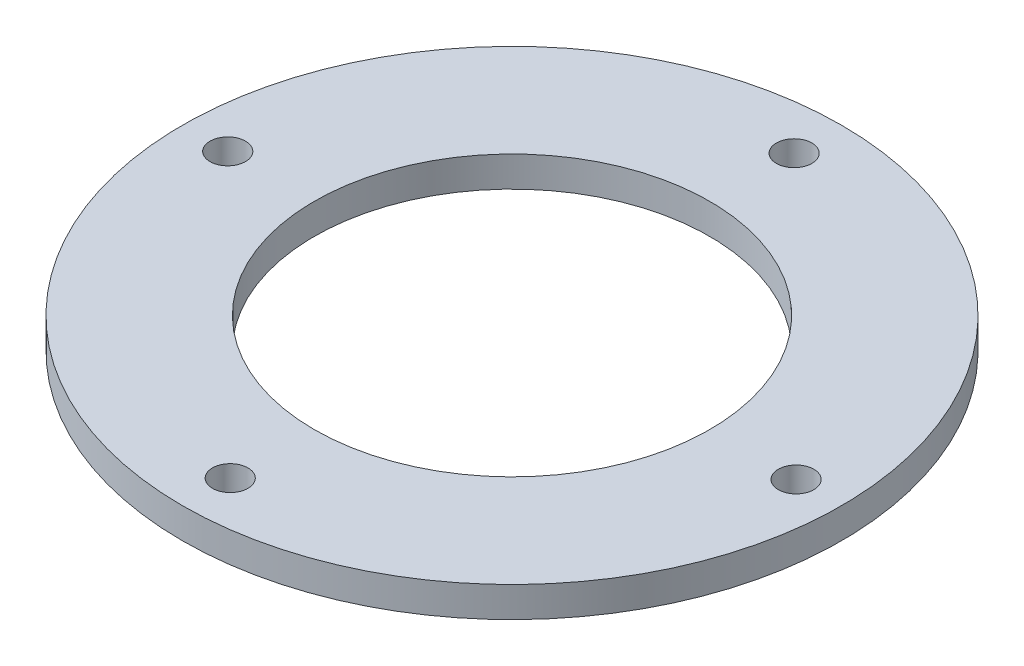
ISO-10303-21;
HEADER;
FILE_DESCRIPTION(('STEP AP214'),'2;1');
FILE_NAME('part.step','',(''),(''),'','','');
FILE_SCHEMA(('AUTOMOTIVE_DESIGN { 1 0 10303 214 1 1 1 1 }'));
ENDSEC;
DATA;
#1=APPLICATION_CONTEXT('core data for automotive mechanical design processes');
#2=APPLICATION_PROTOCOL_DEFINITION('international standard','automotive_design',2000,#1);
#3=PRODUCT_CONTEXT('',#1,'mechanical');
#4=PRODUCT('Part','Part','',(#3));
#5=PRODUCT_RELATED_PRODUCT_CATEGORY('part','',(#4));
#6=PRODUCT_DEFINITION_FORMATION('','',#4);
#7=PRODUCT_DEFINITION_CONTEXT('part definition',#1,'design');
#8=PRODUCT_DEFINITION('design','',#6,#7);
#9=PRODUCT_DEFINITION_SHAPE('','',#8);
#10=(LENGTH_UNIT() NAMED_UNIT(*) SI_UNIT(.MILLI.,.METRE.));
#11=(NAMED_UNIT(*) PLANE_ANGLE_UNIT() SI_UNIT($,.RADIAN.));
#12=(NAMED_UNIT(*) SI_UNIT($,.STERADIAN.) SOLID_ANGLE_UNIT());
#13=UNCERTAINTY_MEASURE_WITH_UNIT(LENGTH_MEASURE(1.E-05),#10,'distance_accuracy_value','');
#14=(GEOMETRIC_REPRESENTATION_CONTEXT(3) GLOBAL_UNCERTAINTY_ASSIGNED_CONTEXT((#13)) GLOBAL_UNIT_ASSIGNED_CONTEXT((#10,
#11,#12)) REPRESENTATION_CONTEXT('',''));
#15=CARTESIAN_POINT('',(0.,0.,0.));
#16=DIRECTION('',(0.,0.,1.));
#17=DIRECTION('',(1.,0.,0.));
#18=AXIS2_PLACEMENT_3D('',#15,#16,#17);
#19=CARTESIAN_POINT('',(0.,3.,0.));
#20=DIRECTION('',(0.,1.,0.));
#21=DIRECTION('',(0.,0.,1.));
#22=AXIS2_PLACEMENT_3D('',#19,#20,#21);
#23=PLANE('',#22);
#24=CARTESIAN_POINT('',(-28.0273872515695,3.,0.00397910375983372));
#25=DIRECTION('',(0.,1.,0.));
#26=DIRECTION('',(0.,0.,1.));
#27=AXIS2_PLACEMENT_3D('',#24,#25,#26);
#28=CIRCLE('',#27,1.75);
#29=CARTESIAN_POINT('',(-28.0273872515695,3.,1.75397910375983));
#30=VERTEX_POINT('',#29);
#31=EDGE_CURVE('E65',#30,#30,#28,.T.);
#32=ORIENTED_EDGE('',*,*,#31,.F.);
#33=EDGE_LOOP('',(#32));
#34=FACE_BOUND('',#33,.T.);
#35=CARTESIAN_POINT('',(28.0161930899202,3.,0.));
#36=DIRECTION('',(0.,1.,0.));
#37=DIRECTION('',(0.,0.,1.));
#38=AXIS2_PLACEMENT_3D('',#35,#36,#37);
#39=CIRCLE('',#38,1.75);
#40=CARTESIAN_POINT('',(28.0161930899202,3.,1.75));
#41=VERTEX_POINT('',#40);
#42=EDGE_CURVE('E68',#41,#41,#39,.T.);
#43=ORIENTED_EDGE('',*,*,#42,.F.);
#44=EDGE_LOOP('',(#43));
#45=FACE_BOUND('',#44,.T.);
#46=CARTESIAN_POINT('',(0.057759674881197,3.,-27.7662693975544));
#47=DIRECTION('',(0.,1.,0.));
#48=DIRECTION('',(0.,0.,1.));
#49=AXIS2_PLACEMENT_3D('',#46,#47,#48);
#50=CIRCLE('',#49,1.75);
#51=CARTESIAN_POINT('',(0.057759674881197,3.,-26.0162693975544));
#52=VERTEX_POINT('',#51);
#53=EDGE_CURVE('E59',#52,#52,#50,.T.);
#54=ORIENTED_EDGE('',*,*,#53,.F.);
#55=EDGE_LOOP('',(#54));
#56=FACE_BOUND('',#55,.T.);
#57=CARTESIAN_POINT('',(0.,3.,27.7888845354006));
#58=DIRECTION('',(0.,1.,0.));
#59=DIRECTION('',(0.,0.,1.));
#60=AXIS2_PLACEMENT_3D('',#57,#58,#59);
#61=CIRCLE('',#60,1.75);
#62=CARTESIAN_POINT('',(0.,3.,29.5388845354006));
#63=VERTEX_POINT('',#62);
#64=EDGE_CURVE('E51',#63,#63,#61,.T.);
#65=ORIENTED_EDGE('',*,*,#64,.F.);
#66=EDGE_LOOP('',(#65));
#67=FACE_BOUND('',#66,.T.);
#68=CARTESIAN_POINT('',(0.,3.,0.));
#69=DIRECTION('',(0.,1.,0.));
#70=DIRECTION('',(0.,0.,1.));
#71=AXIS2_PLACEMENT_3D('',#68,#69,#70);
#72=CIRCLE('',#71,32.5);
#73=CARTESIAN_POINT('',(0.,3.,32.5));
#74=VERTEX_POINT('',#73);
#75=EDGE_CURVE('E10',#74,#74,#72,.T.);
#76=ORIENTED_EDGE('',*,*,#75,.T.);
#77=EDGE_LOOP('',(#76));
#78=FACE_BOUND('',#77,.T.);
#79=CARTESIAN_POINT('',(0.,3.,0.));
#80=DIRECTION('',(0.,1.,0.));
#81=DIRECTION('',(0.,0.,1.));
#82=AXIS2_PLACEMENT_3D('',#79,#80,#81);
#83=CIRCLE('',#82,19.5);
#84=CARTESIAN_POINT('',(0.,3.,19.5));
#85=VERTEX_POINT('',#84);
#86=EDGE_CURVE('E46',#85,#85,#83,.T.);
#87=ORIENTED_EDGE('',*,*,#86,.F.);
#88=EDGE_LOOP('',(#87));
#89=FACE_BOUND('',#88,.T.);
#90=ADVANCED_FACE('F35',(#34,#45,#56,#67,#78,#89),#23,.T.);
#91=CARTESIAN_POINT('',(0.,0.,0.));
#92=DIRECTION('',(0.,1.,0.));
#93=DIRECTION('',(0.,0.,1.));
#94=AXIS2_PLACEMENT_3D('',#91,#92,#93);
#95=PLANE('',#94);
#96=CARTESIAN_POINT('',(-28.0273872515695,0.,0.00397910375983372));
#97=DIRECTION('',(0.,1.,0.));
#98=DIRECTION('',(0.,0.,1.));
#99=AXIS2_PLACEMENT_3D('',#96,#97,#98);
#100=CIRCLE('',#99,1.75);
#101=CARTESIAN_POINT('',(-28.0273872515695,0.,1.75397910375983));
#102=VERTEX_POINT('',#101);
#103=EDGE_CURVE('E71',#102,#102,#100,.T.);
#104=ORIENTED_EDGE('',*,*,#103,.T.);
#105=EDGE_LOOP('',(#104));
#106=FACE_BOUND('',#105,.T.);
#107=CARTESIAN_POINT('',(28.0161930899202,0.,0.));
#108=DIRECTION('',(0.,1.,0.));
#109=DIRECTION('',(0.,0.,1.));
#110=AXIS2_PLACEMENT_3D('',#107,#108,#109);
#111=CIRCLE('',#110,1.75);
#112=CARTESIAN_POINT('',(28.0161930899202,0.,1.75));
#113=VERTEX_POINT('',#112);
#114=EDGE_CURVE('E72',#113,#113,#111,.T.);
#115=ORIENTED_EDGE('',*,*,#114,.T.);
#116=EDGE_LOOP('',(#115));
#117=FACE_BOUND('',#116,.T.);
#118=CARTESIAN_POINT('',(0.057759674881197,0.,-27.7662693975544));
#119=DIRECTION('',(0.,1.,0.));
#120=DIRECTION('',(0.,0.,1.));
#121=AXIS2_PLACEMENT_3D('',#118,#119,#120);
#122=CIRCLE('',#121,1.75);
#123=CARTESIAN_POINT('',(0.057759674881197,0.,-26.0162693975544));
#124=VERTEX_POINT('',#123);
#125=EDGE_CURVE('E62',#124,#124,#122,.T.);
#126=ORIENTED_EDGE('',*,*,#125,.T.);
#127=EDGE_LOOP('',(#126));
#128=FACE_BOUND('',#127,.T.);
#129=CARTESIAN_POINT('',(0.,0.,27.7888845354006));
#130=DIRECTION('',(0.,1.,0.));
#131=DIRECTION('',(0.,0.,1.));
#132=AXIS2_PLACEMENT_3D('',#129,#130,#131);
#133=CIRCLE('',#132,1.75);
#134=CARTESIAN_POINT('',(0.,0.,29.5388845354006));
#135=VERTEX_POINT('',#134);
#136=EDGE_CURVE('E56',#135,#135,#133,.T.);
#137=ORIENTED_EDGE('',*,*,#136,.T.);
#138=EDGE_LOOP('',(#137));
#139=FACE_BOUND('',#138,.T.);
#140=CARTESIAN_POINT('',(0.,0.,0.));
#141=DIRECTION('',(0.,1.,0.));
#142=DIRECTION('',(0.,0.,1.));
#143=AXIS2_PLACEMENT_3D('',#140,#141,#142);
#144=CIRCLE('',#143,32.5);
#145=CARTESIAN_POINT('',(0.,0.,32.5));
#146=VERTEX_POINT('',#145);
#147=EDGE_CURVE('E39',#146,#146,#144,.T.);
#148=ORIENTED_EDGE('',*,*,#147,.F.);
#149=EDGE_LOOP('',(#148));
#150=FACE_BOUND('',#149,.T.);
#151=CARTESIAN_POINT('',(0.,0.,0.));
#152=DIRECTION('',(0.,1.,0.));
#153=DIRECTION('',(0.,0.,1.));
#154=AXIS2_PLACEMENT_3D('',#151,#152,#153);
#155=CIRCLE('',#154,19.5);
#156=CARTESIAN_POINT('',(0.,0.,19.5));
#157=VERTEX_POINT('',#156);
#158=EDGE_CURVE('E48',#157,#157,#155,.T.);
#159=ORIENTED_EDGE('',*,*,#158,.T.);
#160=EDGE_LOOP('',(#159));
#161=FACE_BOUND('',#160,.T.);
#162=ADVANCED_FACE('F78',(#106,#117,#128,#139,#150,#161),#95,.F.);
#163=CARTESIAN_POINT('',(0.,3.,0.));
#164=DIRECTION('',(0.,-1.,0.));
#165=DIRECTION('',(0.,0.,-1.));
#166=AXIS2_PLACEMENT_3D('',#163,#164,#165);
#167=CYLINDRICAL_SURFACE('',#166,32.5);
#168=ORIENTED_EDGE('',*,*,#75,.F.);
#169=EDGE_LOOP('',(#168));
#170=FACE_BOUND('',#169,.T.);
#171=ORIENTED_EDGE('',*,*,#147,.T.);
#172=EDGE_LOOP('',(#171));
#173=FACE_BOUND('',#172,.T.);
#174=ADVANCED_FACE('F37',(#170,#173),#167,.T.);
#175=CARTESIAN_POINT('',(0.,3.,0.));
#176=DIRECTION('',(0.,-1.,0.));
#177=DIRECTION('',(0.,0.,-1.));
#178=AXIS2_PLACEMENT_3D('',#175,#176,#177);
#179=CYLINDRICAL_SURFACE('',#178,19.5);
#180=ORIENTED_EDGE('',*,*,#86,.T.);
#181=EDGE_LOOP('',(#180));
#182=FACE_BOUND('',#181,.T.);
#183=ORIENTED_EDGE('',*,*,#158,.F.);
#184=EDGE_LOOP('',(#183));
#185=FACE_BOUND('',#184,.T.);
#186=ADVANCED_FACE('F101',(#182,#185),#179,.F.);
#187=CARTESIAN_POINT('',(0.,0.,27.7888845354006));
#188=DIRECTION('',(0.,1.,0.));
#189=DIRECTION('',(0.,0.,1.));
#190=AXIS2_PLACEMENT_3D('',#187,#188,#189);
#191=CYLINDRICAL_SURFACE('',#190,1.75);
#192=ORIENTED_EDGE('',*,*,#64,.T.);
#193=EDGE_LOOP('',(#192));
#194=FACE_BOUND('',#193,.T.);
#195=ORIENTED_EDGE('',*,*,#136,.F.);
#196=EDGE_LOOP('',(#195));
#197=FACE_BOUND('',#196,.T.);
#198=ADVANCED_FACE('F104',(#194,#197),#191,.F.);
#199=CARTESIAN_POINT('',(0.057759674881197,0.,-27.7662693975544));
#200=DIRECTION('',(0.,1.,0.));
#201=DIRECTION('',(0.,0.,1.));
#202=AXIS2_PLACEMENT_3D('',#199,#200,#201);
#203=CYLINDRICAL_SURFACE('',#202,1.75);
#204=ORIENTED_EDGE('',*,*,#53,.T.);
#205=EDGE_LOOP('',(#204));
#206=FACE_BOUND('',#205,.T.);
#207=ORIENTED_EDGE('',*,*,#125,.F.);
#208=EDGE_LOOP('',(#207));
#209=FACE_BOUND('',#208,.T.);
#210=ADVANCED_FACE('F89',(#206,#209),#203,.F.);
#211=CARTESIAN_POINT('',(28.0161930899202,0.,0.));
#212=DIRECTION('',(0.,1.,0.));
#213=DIRECTION('',(0.,0.,1.));
#214=AXIS2_PLACEMENT_3D('',#211,#212,#213);
#215=CYLINDRICAL_SURFACE('',#214,1.75);
#216=ORIENTED_EDGE('',*,*,#42,.T.);
#217=EDGE_LOOP('',(#216));
#218=FACE_BOUND('',#217,.T.);
#219=ORIENTED_EDGE('',*,*,#114,.F.);
#220=EDGE_LOOP('',(#219));
#221=FACE_BOUND('',#220,.T.);
#222=ADVANCED_FACE('F83',(#218,#221),#215,.F.);
#223=CARTESIAN_POINT('',(-28.0273872515695,0.,0.00397910375983372));
#224=DIRECTION('',(0.,1.,0.));
#225=DIRECTION('',(0.,0.,1.));
#226=AXIS2_PLACEMENT_3D('',#223,#224,#225);
#227=CYLINDRICAL_SURFACE('',#226,1.75);
#228=ORIENTED_EDGE('',*,*,#31,.T.);
#229=EDGE_LOOP('',(#228));
#230=FACE_BOUND('',#229,.T.);
#231=ORIENTED_EDGE('',*,*,#103,.F.);
#232=EDGE_LOOP('',(#231));
#233=FACE_BOUND('',#232,.T.);
#234=ADVANCED_FACE('F81',(#230,#233),#227,.F.);
#235=CLOSED_SHELL('',(#90,#162,#174,#186,#198,#210,#222,#234));
#236=MANIFOLD_SOLID_BREP('B2',#235);
#237=ADVANCED_BREP_SHAPE_REPRESENTATION('',(#18,#236),#14);
#238=SHAPE_DEFINITION_REPRESENTATION(#9,#237);
ENDSEC;
END-ISO-10303-21;
